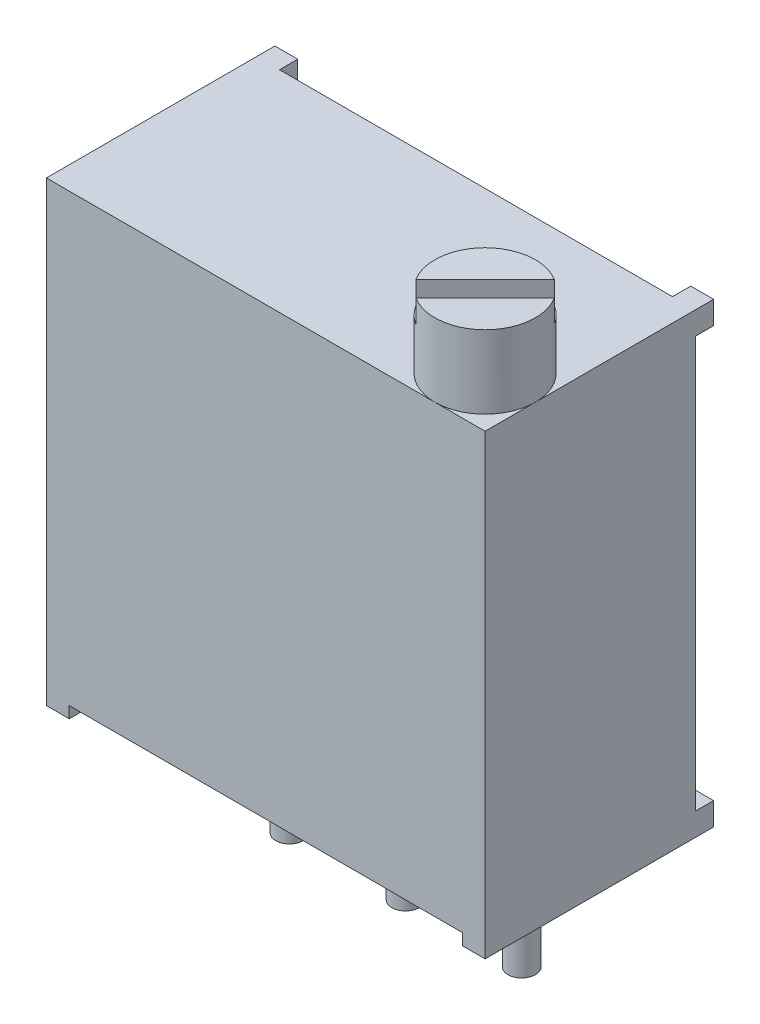
ISO-10303-21;
HEADER;
FILE_DESCRIPTION(('STEP AP214'),'2;1');
FILE_NAME('part.step','',(''),(''),'','','');
FILE_SCHEMA(('AUTOMOTIVE_DESIGN { 1 0 10303 214 1 1 1 1 }'));
ENDSEC;
DATA;
#1=APPLICATION_CONTEXT('core data for automotive mechanical design processes');
#2=APPLICATION_PROTOCOL_DEFINITION('international standard','automotive_design',2000,#1);
#3=PRODUCT_CONTEXT('',#1,'mechanical');
#4=PRODUCT('Part','Part','',(#3));
#5=PRODUCT_RELATED_PRODUCT_CATEGORY('part','',(#4));
#6=PRODUCT_DEFINITION_FORMATION('','',#4);
#7=PRODUCT_DEFINITION_CONTEXT('part definition',#1,'design');
#8=PRODUCT_DEFINITION('design','',#6,#7);
#9=PRODUCT_DEFINITION_SHAPE('','',#8);
#10=(LENGTH_UNIT() NAMED_UNIT(*) SI_UNIT(.MILLI.,.METRE.));
#11=(NAMED_UNIT(*) PLANE_ANGLE_UNIT() SI_UNIT($,.RADIAN.));
#12=(NAMED_UNIT(*) SI_UNIT($,.STERADIAN.) SOLID_ANGLE_UNIT());
#13=UNCERTAINTY_MEASURE_WITH_UNIT(LENGTH_MEASURE(1.E-05),#10,'distance_accuracy_value','');
#14=(GEOMETRIC_REPRESENTATION_CONTEXT(3) GLOBAL_UNCERTAINTY_ASSIGNED_CONTEXT((#13)) GLOBAL_UNIT_ASSIGNED_CONTEXT((#10,
#11,#12)) REPRESENTATION_CONTEXT('',''));
#15=CARTESIAN_POINT('',(0.,0.,0.));
#16=DIRECTION('',(0.,0.,1.));
#17=DIRECTION('',(1.,0.,0.));
#18=AXIS2_PLACEMENT_3D('',#15,#16,#17);
#19=CARTESIAN_POINT('',(1.1,11.6,1.9));
#20=DIRECTION('',(0.,1.,0.));
#21=DIRECTION('',(0.,0.,1.));
#22=AXIS2_PLACEMENT_3D('',#19,#20,#21);
#23=PLANE('',#22);
#24=DIRECTION('',(-0.707106781186547,0.,0.707106781186548));
#25=VECTOR('',#24,1.);
#26=CARTESIAN_POINT('',(0.165760434326207,11.6,2.48068617508052));
#27=LINE('',#26,#25);
#28=CARTESIAN_POINT('',(1.68068617508052,11.6,0.965760434326207));
#29=VERTEX_POINT('',#28);
#30=CARTESIAN_POINT('',(0.165760434326207,11.6,2.48068617508052));
#31=VERTEX_POINT('',#30);
#32=EDGE_CURVE('E87',#29,#31,#27,.T.);
#33=ORIENTED_EDGE('',*,*,#32,.F.);
#34=CARTESIAN_POINT('',(1.1,11.6,1.9));
#35=DIRECTION('',(0.,1.,0.));
#36=DIRECTION('',(0.,0.,1.));
#37=AXIS2_PLACEMENT_3D('',#34,#35,#36);
#38=CIRCLE('',#37,1.1);
#39=EDGE_CURVE('E13',#29,#31,#38,.T.);
#40=ORIENTED_EDGE('',*,*,#39,.T.);
#41=EDGE_LOOP('',(#33,#40));
#42=FACE_BOUND('',#41,.T.);
#43=ADVANCED_FACE('F48',(#42),#23,.T.);
#44=CARTESIAN_POINT('',(1.1,11.6,1.9));
#45=DIRECTION('',(0.,-1.,0.));
#46=DIRECTION('',(0.,0.,-1.));
#47=AXIS2_PLACEMENT_3D('',#44,#45,#46);
#48=CYLINDRICAL_SURFACE('',#47,1.1);
#49=ORIENTED_EDGE('',*,*,#39,.F.);
#50=DIRECTION('',(0.,1.,0.));
#51=VECTOR('',#50,1.);
#52=CARTESIAN_POINT('',(1.68068617508052,11.1,0.965760434326207));
#53=LINE('',#52,#51);
#54=CARTESIAN_POINT('',(1.68068617508052,11.1,0.965760434326207));
#55=VERTEX_POINT('',#54);
#56=EDGE_CURVE('E101',#55,#29,#53,.T.);
#57=ORIENTED_EDGE('',*,*,#56,.F.);
#58=CARTESIAN_POINT('',(1.1,11.1,1.9));
#59=DIRECTION('',(0.,1.,0.));
#60=DIRECTION('',(0.,0.,1.));
#61=AXIS2_PLACEMENT_3D('',#58,#59,#60);
#62=CIRCLE('',#61,1.1);
#63=CARTESIAN_POINT('',(2.03423956567379,11.1,1.31931382491948));
#64=VERTEX_POINT('',#63);
#65=EDGE_CURVE('E105',#64,#55,#62,.T.);
#66=ORIENTED_EDGE('',*,*,#65,.F.);
#67=DIRECTION('',(0.,1.,0.));
#68=VECTOR('',#67,1.);
#69=CARTESIAN_POINT('',(2.03423956567379,11.1,1.31931382491948));
#70=LINE('',#69,#68);
#71=CARTESIAN_POINT('',(2.03423956567379,11.6,1.31931382491948));
#72=VERTEX_POINT('',#71);
#73=EDGE_CURVE('E94',#64,#72,#70,.T.);
#74=ORIENTED_EDGE('',*,*,#73,.T.);
#75=CARTESIAN_POINT('',(0.519313824919481,11.6,2.83423956567379));
#76=VERTEX_POINT('',#75);
#77=EDGE_CURVE('E57',#76,#72,#38,.T.);
#78=ORIENTED_EDGE('',*,*,#77,.F.);
#79=DIRECTION('',(0.,1.,0.));
#80=VECTOR('',#79,1.);
#81=CARTESIAN_POINT('',(0.519313824919481,11.1,2.83423956567379));
#82=LINE('',#81,#80);
#83=CARTESIAN_POINT('',(0.519313824919481,11.1,2.83423956567379));
#84=VERTEX_POINT('',#83);
#85=EDGE_CURVE('E64',#84,#76,#82,.T.);
#86=ORIENTED_EDGE('',*,*,#85,.F.);
#87=CARTESIAN_POINT('',(1.1,11.1,1.9));
#88=DIRECTION('',(0.,1.,0.));
#89=DIRECTION('',(0.,0.,1.));
#90=AXIS2_PLACEMENT_3D('',#87,#88,#89);
#91=CIRCLE('',#90,1.1);
#92=CARTESIAN_POINT('',(0.165760434326207,11.1,2.48068617508052));
#93=VERTEX_POINT('',#92);
#94=EDGE_CURVE('E107',#93,#84,#91,.T.);
#95=ORIENTED_EDGE('',*,*,#94,.F.);
#96=DIRECTION('',(0.,1.,0.));
#97=VECTOR('',#96,1.);
#98=CARTESIAN_POINT('',(0.165760434326207,11.1,2.48068617508052));
#99=LINE('',#98,#97);
#100=EDGE_CURVE('E73',#93,#31,#99,.T.);
#101=ORIENTED_EDGE('',*,*,#100,.T.);
#102=EDGE_LOOP('',(#49,#57,#66,#74,#78,#86,#95,#101));
#103=FACE_BOUND('',#102,.T.);
#104=CARTESIAN_POINT('',(1.1,10.,1.9));
#105=DIRECTION('',(0.,1.,0.));
#106=DIRECTION('',(0.,0.,1.));
#107=AXIS2_PLACEMENT_3D('',#104,#105,#106);
#108=CIRCLE('',#107,1.1);
#109=CARTESIAN_POINT('',(1.1,10.,3.));
#110=VERTEX_POINT('',#109);
#111=EDGE_CURVE('E52',#110,#110,#108,.T.);
#112=ORIENTED_EDGE('',*,*,#111,.T.);
#113=EDGE_LOOP('',(#112));
#114=FACE_BOUND('',#113,.T.);
#115=ADVANCED_FACE('F50',(#103,#114),#48,.T.);
#116=DIRECTION('',(0.707106781186547,0.,-0.707106781186548));
#117=VECTOR('',#116,1.);
#118=CARTESIAN_POINT('',(2.03423956567379,11.6,1.31931382491948));
#119=LINE('',#118,#117);
#120=EDGE_CURVE('E96',#76,#72,#119,.T.);
#121=ORIENTED_EDGE('',*,*,#120,.F.);
#122=ORIENTED_EDGE('',*,*,#77,.T.);
#123=EDGE_LOOP('',(#121,#122));
#124=FACE_BOUND('',#123,.T.);
#125=ADVANCED_FACE('F128',(#124),#23,.T.);
#126=CARTESIAN_POINT('',(1.1,10.,1.9));
#127=DIRECTION('',(0.,1.,0.));
#128=DIRECTION('',(0.,0.,1.));
#129=AXIS2_PLACEMENT_3D('',#126,#127,#128);
#130=PLANE('',#129);
#131=ORIENTED_EDGE('',*,*,#111,.F.);
#132=EDGE_LOOP('',(#131));
#133=FACE_BOUND('',#132,.T.);
#134=ADVANCED_FACE('F125',(#133),#130,.F.);
#135=CARTESIAN_POINT('',(0.165760434326207,11.1,2.48068617508052));
#136=DIRECTION('',(-0.707106781186548,0.,-0.707106781186547));
#137=DIRECTION('',(-0.707106781186547,0.,0.707106781186548));
#138=AXIS2_PLACEMENT_3D('',#135,#136,#137);
#139=PLANE('',#138);
#140=ORIENTED_EDGE('',*,*,#32,.T.);
#141=ORIENTED_EDGE('',*,*,#100,.F.);
#142=DIRECTION('',(-0.707106781186547,0.,0.707106781186548));
#143=VECTOR('',#142,1.);
#144=CARTESIAN_POINT('',(0.165760434326207,11.1,2.48068617508052));
#145=LINE('',#144,#143);
#146=EDGE_CURVE('E112',#55,#93,#145,.T.);
#147=ORIENTED_EDGE('',*,*,#146,.F.);
#148=ORIENTED_EDGE('',*,*,#56,.T.);
#149=EDGE_LOOP('',(#140,#141,#147,#148));
#150=FACE_BOUND('',#149,.T.);
#151=ADVANCED_FACE('F127',(#150),#139,.F.);
#152=CARTESIAN_POINT('',(2.03423956567379,11.1,1.31931382491948));
#153=DIRECTION('',(0.707106781186548,0.,0.707106781186547));
#154=DIRECTION('',(0.707106781186547,0.,-0.707106781186548));
#155=AXIS2_PLACEMENT_3D('',#152,#153,#154);
#156=PLANE('',#155);
#157=ORIENTED_EDGE('',*,*,#120,.T.);
#158=ORIENTED_EDGE('',*,*,#73,.F.);
#159=DIRECTION('',(0.707106781186547,0.,-0.707106781186548));
#160=VECTOR('',#159,1.);
#161=CARTESIAN_POINT('',(2.03423956567379,11.1,1.31931382491948));
#162=LINE('',#161,#160);
#163=EDGE_CURVE('E91',#84,#64,#162,.T.);
#164=ORIENTED_EDGE('',*,*,#163,.F.);
#165=ORIENTED_EDGE('',*,*,#85,.T.);
#166=EDGE_LOOP('',(#157,#158,#164,#165));
#167=FACE_BOUND('',#166,.T.);
#168=ADVANCED_FACE('F95',(#167),#156,.F.);
#169=CARTESIAN_POINT('',(1.1,11.1,1.9));
#170=DIRECTION('',(0.,1.,0.));
#171=DIRECTION('',(0.,0.,1.));
#172=AXIS2_PLACEMENT_3D('',#169,#170,#171);
#173=PLANE('',#172);
#174=ORIENTED_EDGE('',*,*,#94,.T.);
#175=ORIENTED_EDGE('',*,*,#163,.T.);
#176=ORIENTED_EDGE('',*,*,#65,.T.);
#177=ORIENTED_EDGE('',*,*,#146,.T.);
#178=EDGE_LOOP('',(#174,#175,#176,#177));
#179=FACE_BOUND('',#178,.T.);
#180=ADVANCED_FACE('F104',(#179),#173,.T.);
#181=CLOSED_SHELL('',(#43,#115,#125,#134,#151,#168,#180));
#182=MANIFOLD_SOLID_BREP('B2',#181);
#183=CARTESIAN_POINT('',(-6.9,0.25,3.));
#184=DIRECTION('',(0.,1.,0.));
#185=DIRECTION('',(0.,0.,1.));
#186=AXIS2_PLACEMENT_3D('',#183,#184,#185);
#187=PLANE('',#186);
#188=CARTESIAN_POINT('',(-2.54,0.25,0.));
#189=DIRECTION('',(0.,1.,0.));
#190=DIRECTION('',(0.,0.,1.));
#191=AXIS2_PLACEMENT_3D('',#188,#189,#190);
#192=CIRCLE('',#191,0.3);
#193=CARTESIAN_POINT('',(-2.54,0.25,0.3));
#194=VERTEX_POINT('',#193);
#195=EDGE_CURVE('E194',#194,#194,#192,.F.);
#196=ORIENTED_EDGE('',*,*,#195,.F.);
#197=EDGE_LOOP('',(#196));
#198=FACE_BOUND('',#197,.T.);
#199=DIRECTION('',(0.,0.,-1.));
#200=VECTOR('',#199,1.);
#201=CARTESIAN_POINT('',(-6.9,0.25,-1.6));
#202=LINE('',#201,#200);
#203=CARTESIAN_POINT('',(-6.9,0.25,3.));
#204=VERTEX_POINT('',#203);
#205=CARTESIAN_POINT('',(-6.9,0.25,-1.6));
#206=VERTEX_POINT('',#205);
#207=EDGE_CURVE('E320',#204,#206,#202,.T.);
#208=ORIENTED_EDGE('',*,*,#207,.T.);
#209=DIRECTION('',(1.,0.,0.));
#210=VECTOR('',#209,1.);
#211=CARTESIAN_POINT('',(-6.9,0.25,-1.6));
#212=LINE('',#211,#210);
#213=CARTESIAN_POINT('',(1.7,0.25,-1.6));
#214=VERTEX_POINT('',#213);
#215=EDGE_CURVE('E324',#206,#214,#212,.T.);
#216=ORIENTED_EDGE('',*,*,#215,.T.);
#217=DIRECTION('',(0.,0.,1.));
#218=VECTOR('',#217,1.);
#219=CARTESIAN_POINT('',(1.7,0.25,-1.6));
#220=LINE('',#219,#218);
#221=CARTESIAN_POINT('',(1.7,0.25,3.));
#222=VERTEX_POINT('',#221);
#223=EDGE_CURVE('E341',#214,#222,#220,.T.);
#224=ORIENTED_EDGE('',*,*,#223,.T.);
#225=DIRECTION('',(-1.,0.,0.));
#226=VECTOR('',#225,1.);
#227=CARTESIAN_POINT('',(-6.9,0.25,3.));
#228=LINE('',#227,#226);
#229=EDGE_CURVE('E327',#222,#204,#228,.T.);
#230=ORIENTED_EDGE('',*,*,#229,.T.);
#231=EDGE_LOOP('',(#208,#216,#224,#230));
#232=FACE_BOUND('',#231,.T.);
#233=CARTESIAN_POINT('',(0.,0.25,0.));
#234=DIRECTION('',(0.,1.,0.));
#235=DIRECTION('',(0.,0.,1.));
#236=AXIS2_PLACEMENT_3D('',#233,#234,#235);
#237=CIRCLE('',#236,0.3);
#238=CARTESIAN_POINT('',(0.,0.25,0.3));
#239=VERTEX_POINT('',#238);
#240=EDGE_CURVE('E455',#239,#239,#237,.F.);
#241=ORIENTED_EDGE('',*,*,#240,.F.);
#242=EDGE_LOOP('',(#241));
#243=FACE_BOUND('',#242,.T.);
#244=CARTESIAN_POINT('',(-5.08,0.25,0.));
#245=DIRECTION('',(0.,1.,0.));
#246=DIRECTION('',(0.,0.,1.));
#247=AXIS2_PLACEMENT_3D('',#244,#245,#246);
#248=CIRCLE('',#247,0.3);
#249=CARTESIAN_POINT('',(-5.08,0.25,0.299999999999999));
#250=VERTEX_POINT('',#249);
#251=EDGE_CURVE('E46',#250,#250,#248,.F.);
#252=ORIENTED_EDGE('',*,*,#251,.F.);
#253=EDGE_LOOP('',(#252));
#254=FACE_BOUND('',#253,.T.);
#255=ADVANCED_FACE('F185',(#198,#232,#243,#254),#187,.F.);
#256=CARTESIAN_POINT('',(2.2,0.,3.));
#257=DIRECTION('',(0.,-1.,0.));
#258=DIRECTION('',(0.,0.,-1.));
#259=AXIS2_PLACEMENT_3D('',#256,#257,#258);
#260=PLANE('',#259);
#261=DIRECTION('',(0.,0.,-1.));
#262=VECTOR('',#261,1.);
#263=CARTESIAN_POINT('',(-6.9,0.,-1.6));
#264=LINE('',#263,#262);
#265=CARTESIAN_POINT('',(-6.9,0.,3.));
#266=VERTEX_POINT('',#265);
#267=CARTESIAN_POINT('',(-6.9,0.,-2.));
#268=VERTEX_POINT('',#267);
#269=EDGE_CURVE('E362',#266,#268,#264,.T.);
#270=ORIENTED_EDGE('',*,*,#269,.F.);
#271=DIRECTION('',(1.,0.,0.));
#272=VECTOR('',#271,1.);
#273=CARTESIAN_POINT('',(2.2,0.,3.));
#274=LINE('',#273,#272);
#275=CARTESIAN_POINT('',(-7.4,0.,3.));
#276=VERTEX_POINT('',#275);
#277=EDGE_CURVE('E429',#276,#266,#274,.T.);
#278=ORIENTED_EDGE('',*,*,#277,.F.);
#279=DIRECTION('',(0.,0.,1.));
#280=VECTOR('',#279,1.);
#281=CARTESIAN_POINT('',(-7.4,0.,-2.));
#282=LINE('',#281,#280);
#283=CARTESIAN_POINT('',(-7.4,0.,-2.));
#284=VERTEX_POINT('',#283);
#285=EDGE_CURVE('E219',#284,#276,#282,.T.);
#286=ORIENTED_EDGE('',*,*,#285,.F.);
#287=DIRECTION('',(-1.,0.,0.));
#288=VECTOR('',#287,1.);
#289=CARTESIAN_POINT('',(2.2,0.,-2.));
#290=LINE('',#289,#288);
#291=EDGE_CURVE('E437',#268,#284,#290,.T.);
#292=ORIENTED_EDGE('',*,*,#291,.F.);
#293=EDGE_LOOP('',(#270,#278,#286,#292));
#294=FACE_BOUND('',#293,.T.);
#295=ADVANCED_FACE('F463',(#294),#260,.T.);
#296=CARTESIAN_POINT('',(2.2,10.,-2.));
#297=DIRECTION('',(0.,0.,1.));
#298=DIRECTION('',(1.,0.,0.));
#299=AXIS2_PLACEMENT_3D('',#296,#297,#298);
#300=PLANE('',#299);
#301=DIRECTION('',(-1.,0.,0.));
#302=VECTOR('',#301,1.);
#303=CARTESIAN_POINT('',(-7.4,9.5,-2.));
#304=LINE('',#303,#302);
#305=CARTESIAN_POINT('',(-6.9,9.5,-2.));
#306=VERTEX_POINT('',#305);
#307=CARTESIAN_POINT('',(-7.4,9.5,-2.));
#308=VERTEX_POINT('',#307);
#309=EDGE_CURVE('E406',#306,#308,#304,.T.);
#310=ORIENTED_EDGE('',*,*,#309,.T.);
#311=DIRECTION('',(0.,-1.,0.));
#312=VECTOR('',#311,1.);
#313=CARTESIAN_POINT('',(-7.4,10.,-2.));
#314=LINE('',#313,#312);
#315=CARTESIAN_POINT('',(-7.4,10.,-2.));
#316=VERTEX_POINT('',#315);
#317=EDGE_CURVE('E448',#316,#308,#314,.T.);
#318=ORIENTED_EDGE('',*,*,#317,.F.);
#319=DIRECTION('',(-1.,0.,0.));
#320=VECTOR('',#319,1.);
#321=CARTESIAN_POINT('',(2.2,10.,-2.));
#322=LINE('',#321,#320);
#323=CARTESIAN_POINT('',(-6.9,10.,-2.));
#324=VERTEX_POINT('',#323);
#325=EDGE_CURVE('E428',#324,#316,#322,.T.);
#326=ORIENTED_EDGE('',*,*,#325,.F.);
#327=DIRECTION('',(0.,-1.,0.));
#328=VECTOR('',#327,1.);
#329=CARTESIAN_POINT('',(-6.9,10.,-2.));
#330=LINE('',#329,#328);
#331=EDGE_CURVE('E397',#324,#306,#330,.T.);
#332=ORIENTED_EDGE('',*,*,#331,.T.);
#333=EDGE_LOOP('',(#310,#318,#326,#332));
#334=FACE_BOUND('',#333,.T.);
#335=ADVANCED_FACE('F468',(#334),#300,.F.);
#336=DIRECTION('',(0.,1.,0.));
#337=VECTOR('',#336,1.);
#338=CARTESIAN_POINT('',(1.7,10.,-2.));
#339=LINE('',#338,#337);
#340=CARTESIAN_POINT('',(1.7,9.5,-2.));
#341=VERTEX_POINT('',#340);
#342=CARTESIAN_POINT('',(1.7,10.,-2.));
#343=VERTEX_POINT('',#342);
#344=EDGE_CURVE('E387',#341,#343,#339,.T.);
#345=ORIENTED_EDGE('',*,*,#344,.T.);
#346=CARTESIAN_POINT('',(2.2,10.,-2.));
#347=VERTEX_POINT('',#346);
#348=EDGE_CURVE('E430',#347,#343,#322,.T.);
#349=ORIENTED_EDGE('',*,*,#348,.F.);
#350=DIRECTION('',(0.,-1.,0.));
#351=VECTOR('',#350,1.);
#352=CARTESIAN_POINT('',(2.2,10.,-2.));
#353=LINE('',#352,#351);
#354=CARTESIAN_POINT('',(2.2,9.5,-2.));
#355=VERTEX_POINT('',#354);
#356=EDGE_CURVE('E452',#347,#355,#353,.T.);
#357=ORIENTED_EDGE('',*,*,#356,.T.);
#358=DIRECTION('',(-1.,0.,0.));
#359=VECTOR('',#358,1.);
#360=CARTESIAN_POINT('',(2.2,9.5,-2.));
#361=LINE('',#360,#359);
#362=EDGE_CURVE('E378',#355,#341,#361,.T.);
#363=ORIENTED_EDGE('',*,*,#362,.T.);
#364=EDGE_LOOP('',(#345,#349,#357,#363));
#365=FACE_BOUND('',#364,.T.);
#366=ADVANCED_FACE('F520',(#365),#300,.F.);
#367=DIRECTION('',(1.,0.,0.));
#368=VECTOR('',#367,1.);
#369=CARTESIAN_POINT('',(2.2,0.499999999999999,-2.));
#370=LINE('',#369,#368);
#371=CARTESIAN_POINT('',(1.7,0.499999999999999,-2.));
#372=VERTEX_POINT('',#371);
#373=CARTESIAN_POINT('',(2.2,0.499999999999999,-2.));
#374=VERTEX_POINT('',#373);
#375=EDGE_CURVE('E368',#372,#374,#370,.T.);
#376=ORIENTED_EDGE('',*,*,#375,.T.);
#377=CARTESIAN_POINT('',(2.2,0.,-2.));
#378=VERTEX_POINT('',#377);
#379=EDGE_CURVE('E451',#374,#378,#353,.T.);
#380=ORIENTED_EDGE('',*,*,#379,.T.);
#381=CARTESIAN_POINT('',(1.7,0.,-2.));
#382=VERTEX_POINT('',#381);
#383=EDGE_CURVE('E438',#378,#382,#290,.T.);
#384=ORIENTED_EDGE('',*,*,#383,.T.);
#385=DIRECTION('',(0.,1.,0.));
#386=VECTOR('',#385,1.);
#387=CARTESIAN_POINT('',(1.7,0.,-2.));
#388=LINE('',#387,#386);
#389=EDGE_CURVE('E364',#382,#372,#388,.T.);
#390=ORIENTED_EDGE('',*,*,#389,.T.);
#391=EDGE_LOOP('',(#376,#380,#384,#390));
#392=FACE_BOUND('',#391,.T.);
#393=ADVANCED_FACE('F525',(#392),#300,.F.);
#394=DIRECTION('',(0.,-1.,0.));
#395=VECTOR('',#394,1.);
#396=CARTESIAN_POINT('',(-6.9,0.,-2.));
#397=LINE('',#396,#395);
#398=CARTESIAN_POINT('',(-6.9,0.499999999999999,-2.));
#399=VERTEX_POINT('',#398);
#400=EDGE_CURVE('E352',#399,#268,#397,.T.);
#401=ORIENTED_EDGE('',*,*,#400,.T.);
#402=ORIENTED_EDGE('',*,*,#291,.T.);
#403=CARTESIAN_POINT('',(-7.4,0.499999999999999,-2.));
#404=VERTEX_POINT('',#403);
#405=EDGE_CURVE('E447',#404,#284,#314,.T.);
#406=ORIENTED_EDGE('',*,*,#405,.F.);
#407=DIRECTION('',(1.,0.,0.));
#408=VECTOR('',#407,1.);
#409=CARTESIAN_POINT('',(-7.4,0.499999999999999,-2.));
#410=LINE('',#409,#408);
#411=EDGE_CURVE('E356',#404,#399,#410,.T.);
#412=ORIENTED_EDGE('',*,*,#411,.T.);
#413=EDGE_LOOP('',(#401,#402,#406,#412));
#414=FACE_BOUND('',#413,.T.);
#415=ADVANCED_FACE('F518',(#414),#300,.F.);
#416=CARTESIAN_POINT('',(-7.4,10.,-2.));
#417=DIRECTION('',(1.,0.,0.));
#418=DIRECTION('',(0.,0.,-1.));
#419=AXIS2_PLACEMENT_3D('',#416,#417,#418);
#420=PLANE('',#419);
#421=DIRECTION('',(0.,0.,-1.));
#422=VECTOR('',#421,1.);
#423=CARTESIAN_POINT('',(-7.4,9.5,-1.6));
#424=LINE('',#423,#422);
#425=CARTESIAN_POINT('',(-7.4,9.5,-1.6));
#426=VERTEX_POINT('',#425);
#427=EDGE_CURVE('E414',#426,#308,#424,.T.);
#428=ORIENTED_EDGE('',*,*,#427,.F.);
#429=DIRECTION('',(0.,1.,0.));
#430=VECTOR('',#429,1.);
#431=CARTESIAN_POINT('',(-7.4,10.,-1.6));
#432=LINE('',#431,#430);
#433=CARTESIAN_POINT('',(-7.4,0.499999999999999,-1.6));
#434=VERTEX_POINT('',#433);
#435=EDGE_CURVE('E422',#434,#426,#432,.T.);
#436=ORIENTED_EDGE('',*,*,#435,.F.);
#437=DIRECTION('',(0.,0.,-1.));
#438=VECTOR('',#437,1.);
#439=CARTESIAN_POINT('',(-7.4,0.499999999999999,-1.6));
#440=LINE('',#439,#438);
#441=EDGE_CURVE('E347',#434,#404,#440,.T.);
#442=ORIENTED_EDGE('',*,*,#441,.T.);
#443=ORIENTED_EDGE('',*,*,#405,.T.);
#444=ORIENTED_EDGE('',*,*,#285,.T.);
#445=DIRECTION('',(0.,-1.,0.));
#446=VECTOR('',#445,1.);
#447=CARTESIAN_POINT('',(-7.4,10.,3.));
#448=LINE('',#447,#446);
#449=CARTESIAN_POINT('',(-7.4,10.,3.));
#450=VERTEX_POINT('',#449);
#451=EDGE_CURVE('E445',#450,#276,#448,.T.);
#452=ORIENTED_EDGE('',*,*,#451,.F.);
#453=DIRECTION('',(0.,0.,1.));
#454=VECTOR('',#453,1.);
#455=CARTESIAN_POINT('',(-7.4,10.,-2.));
#456=LINE('',#455,#454);
#457=EDGE_CURVE('E432',#316,#450,#456,.T.);
#458=ORIENTED_EDGE('',*,*,#457,.F.);
#459=ORIENTED_EDGE('',*,*,#317,.T.);
#460=EDGE_LOOP('',(#428,#436,#442,#443,#444,#452,#458,#459));
#461=FACE_BOUND('',#460,.T.);
#462=ADVANCED_FACE('F513',(#461),#420,.F.);
#463=CARTESIAN_POINT('',(1.7,0.,3.));
#464=VERTEX_POINT('',#463);
#465=CARTESIAN_POINT('',(2.2,0.,3.));
#466=VERTEX_POINT('',#465);
#467=EDGE_CURVE('E226',#464,#466,#274,.T.);
#468=ORIENTED_EDGE('',*,*,#467,.F.);
#469=DIRECTION('',(0.,0.,-1.));
#470=VECTOR('',#469,1.);
#471=CARTESIAN_POINT('',(1.7,0.,-1.6));
#472=LINE('',#471,#470);
#473=EDGE_CURVE('E371',#464,#382,#472,.T.);
#474=ORIENTED_EDGE('',*,*,#473,.T.);
#475=ORIENTED_EDGE('',*,*,#383,.F.);
#476=DIRECTION('',(0.,0.,-1.));
#477=VECTOR('',#476,1.);
#478=CARTESIAN_POINT('',(2.2,0.,-2.));
#479=LINE('',#478,#477);
#480=EDGE_CURVE('E426',#466,#378,#479,.T.);
#481=ORIENTED_EDGE('',*,*,#480,.F.);
#482=EDGE_LOOP('',(#468,#474,#475,#481));
#483=FACE_BOUND('',#482,.T.);
#484=ADVANCED_FACE('F471',(#483),#260,.T.);
#485=CARTESIAN_POINT('',(2.2,10.,-2.));
#486=DIRECTION('',(-1.,0.,0.));
#487=DIRECTION('',(0.,0.,1.));
#488=AXIS2_PLACEMENT_3D('',#485,#486,#487);
#489=PLANE('',#488);
#490=DIRECTION('',(0.,0.,-1.));
#491=VECTOR('',#490,1.);
#492=CARTESIAN_POINT('',(2.2,0.499999999999999,-1.6));
#493=LINE('',#492,#491);
#494=CARTESIAN_POINT('',(2.2,0.499999999999999,-1.6));
#495=VERTEX_POINT('',#494);
#496=EDGE_CURVE('E376',#495,#374,#493,.T.);
#497=ORIENTED_EDGE('',*,*,#496,.F.);
#498=DIRECTION('',(0.,-1.,0.));
#499=VECTOR('',#498,1.);
#500=CARTESIAN_POINT('',(2.2,10.,-1.6));
#501=LINE('',#500,#499);
#502=CARTESIAN_POINT('',(2.2,9.5,-1.6));
#503=VERTEX_POINT('',#502);
#504=EDGE_CURVE('E424',#503,#495,#501,.T.);
#505=ORIENTED_EDGE('',*,*,#504,.F.);
#506=DIRECTION('',(0.,0.,-1.));
#507=VECTOR('',#506,1.);
#508=CARTESIAN_POINT('',(2.2,9.5,-1.6));
#509=LINE('',#508,#507);
#510=EDGE_CURVE('E390',#503,#355,#509,.T.);
#511=ORIENTED_EDGE('',*,*,#510,.T.);
#512=ORIENTED_EDGE('',*,*,#356,.F.);
#513=DIRECTION('',(0.,0.,-1.));
#514=VECTOR('',#513,1.);
#515=CARTESIAN_POINT('',(2.2,10.,-2.));
#516=LINE('',#515,#514);
#517=CARTESIAN_POINT('',(2.2,10.,3.));
#518=VERTEX_POINT('',#517);
#519=EDGE_CURVE('E231',#518,#347,#516,.T.);
#520=ORIENTED_EDGE('',*,*,#519,.F.);
#521=DIRECTION('',(0.,-1.,0.));
#522=VECTOR('',#521,1.);
#523=CARTESIAN_POINT('',(2.2,10.,3.));
#524=LINE('',#523,#522);
#525=EDGE_CURVE('E435',#518,#466,#524,.T.);
#526=ORIENTED_EDGE('',*,*,#525,.T.);
#527=ORIENTED_EDGE('',*,*,#480,.T.);
#528=ORIENTED_EDGE('',*,*,#379,.F.);
#529=EDGE_LOOP('',(#497,#505,#511,#512,#520,#526,#527,#528));
#530=FACE_BOUND('',#529,.T.);
#531=ADVANCED_FACE('F187',(#530),#489,.F.);
#532=CARTESIAN_POINT('',(2.2,10.,3.));
#533=DIRECTION('',(0.,0.,-1.));
#534=DIRECTION('',(-1.,0.,0.));
#535=AXIS2_PLACEMENT_3D('',#532,#533,#534);
#536=PLANE('',#535);
#537=ORIENTED_EDGE('',*,*,#277,.T.);
#538=DIRECTION('',(0.,-1.,0.));
#539=VECTOR('',#538,1.);
#540=CARTESIAN_POINT('',(-6.9,0.25,3.));
#541=LINE('',#540,#539);
#542=EDGE_CURVE('E359',#204,#266,#541,.T.);
#543=ORIENTED_EDGE('',*,*,#542,.F.);
#544=ORIENTED_EDGE('',*,*,#229,.F.);
#545=DIRECTION('',(0.,-1.,0.));
#546=VECTOR('',#545,1.);
#547=CARTESIAN_POINT('',(1.7,0.25,3.));
#548=LINE('',#547,#546);
#549=EDGE_CURVE('E560',#222,#464,#548,.T.);
#550=ORIENTED_EDGE('',*,*,#549,.T.);
#551=ORIENTED_EDGE('',*,*,#467,.T.);
#552=ORIENTED_EDGE('',*,*,#525,.F.);
#553=DIRECTION('',(1.,0.,0.));
#554=VECTOR('',#553,1.);
#555=CARTESIAN_POINT('',(2.2,10.,3.));
#556=LINE('',#555,#554);
#557=EDGE_CURVE('E202',#450,#518,#556,.T.);
#558=ORIENTED_EDGE('',*,*,#557,.F.);
#559=ORIENTED_EDGE('',*,*,#451,.T.);
#560=EDGE_LOOP('',(#537,#543,#544,#550,#551,#552,#558,#559));
#561=FACE_BOUND('',#560,.T.);
#562=ADVANCED_FACE('F510',(#561),#536,.F.);
#563=CARTESIAN_POINT('',(2.2,10.,3.));
#564=DIRECTION('',(0.,-1.,0.));
#565=DIRECTION('',(0.,0.,-1.));
#566=AXIS2_PLACEMENT_3D('',#563,#564,#565);
#567=PLANE('',#566);
#568=DIRECTION('',(0.,0.,-1.));
#569=VECTOR('',#568,1.);
#570=CARTESIAN_POINT('',(1.7,10.,-1.6));
#571=LINE('',#570,#569);
#572=CARTESIAN_POINT('',(1.7,10.,-1.6));
#573=VERTEX_POINT('',#572);
#574=EDGE_CURVE('E395',#573,#343,#571,.T.);
#575=ORIENTED_EDGE('',*,*,#574,.F.);
#576=DIRECTION('',(1.,0.,0.));
#577=VECTOR('',#576,1.);
#578=CARTESIAN_POINT('',(2.2,10.,-1.6));
#579=LINE('',#578,#577);
#580=CARTESIAN_POINT('',(-6.9,10.,-1.6));
#581=VERTEX_POINT('',#580);
#582=EDGE_CURVE('E416',#581,#573,#579,.T.);
#583=ORIENTED_EDGE('',*,*,#582,.F.);
#584=DIRECTION('',(0.,0.,-1.));
#585=VECTOR('',#584,1.);
#586=CARTESIAN_POINT('',(-6.9,10.,-1.6));
#587=LINE('',#586,#585);
#588=EDGE_CURVE('E409',#581,#324,#587,.T.);
#589=ORIENTED_EDGE('',*,*,#588,.T.);
#590=ORIENTED_EDGE('',*,*,#325,.T.);
#591=ORIENTED_EDGE('',*,*,#457,.T.);
#592=ORIENTED_EDGE('',*,*,#557,.T.);
#593=ORIENTED_EDGE('',*,*,#519,.T.);
#594=ORIENTED_EDGE('',*,*,#348,.T.);
#595=EDGE_LOOP('',(#575,#583,#589,#590,#591,#592,#593,#594));
#596=FACE_BOUND('',#595,.T.);
#597=ADVANCED_FACE('F508',(#596),#567,.F.);
#598=CARTESIAN_POINT('',(-2.6,5.,-1.6));
#599=DIRECTION('',(0.,0.,-1.));
#600=DIRECTION('',(-1.,0.,0.));
#601=AXIS2_PLACEMENT_3D('',#598,#599,#600);
#602=PLANE('',#601);
#603=ORIENTED_EDGE('',*,*,#215,.F.);
#604=DIRECTION('',(0.,-1.,0.));
#605=VECTOR('',#604,1.);
#606=CARTESIAN_POINT('',(-6.9,0.,-1.6));
#607=LINE('',#606,#605);
#608=CARTESIAN_POINT('',(-6.9,0.499999999999999,-1.6));
#609=VERTEX_POINT('',#608);
#610=EDGE_CURVE('E337',#609,#206,#607,.T.);
#611=ORIENTED_EDGE('',*,*,#610,.F.);
#612=DIRECTION('',(1.,0.,0.));
#613=VECTOR('',#612,1.);
#614=CARTESIAN_POINT('',(-7.4,0.499999999999999,-1.6));
#615=LINE('',#614,#613);
#616=EDGE_CURVE('E348',#434,#609,#615,.T.);
#617=ORIENTED_EDGE('',*,*,#616,.F.);
#618=ORIENTED_EDGE('',*,*,#435,.T.);
#619=DIRECTION('',(-1.,0.,0.));
#620=VECTOR('',#619,1.);
#621=CARTESIAN_POINT('',(-7.4,9.5,-1.6));
#622=LINE('',#621,#620);
#623=CARTESIAN_POINT('',(-6.9,9.5,-1.6));
#624=VERTEX_POINT('',#623);
#625=EDGE_CURVE('E405',#624,#426,#622,.T.);
#626=ORIENTED_EDGE('',*,*,#625,.F.);
#627=DIRECTION('',(0.,-1.,0.));
#628=VECTOR('',#627,1.);
#629=CARTESIAN_POINT('',(-6.9,10.,-1.6));
#630=LINE('',#629,#628);
#631=EDGE_CURVE('E402',#581,#624,#630,.T.);
#632=ORIENTED_EDGE('',*,*,#631,.F.);
#633=ORIENTED_EDGE('',*,*,#582,.T.);
#634=DIRECTION('',(0.,1.,0.));
#635=VECTOR('',#634,1.);
#636=CARTESIAN_POINT('',(1.7,10.,-1.6));
#637=LINE('',#636,#635);
#638=CARTESIAN_POINT('',(1.7,9.5,-1.6));
#639=VERTEX_POINT('',#638);
#640=EDGE_CURVE('E386',#639,#573,#637,.T.);
#641=ORIENTED_EDGE('',*,*,#640,.F.);
#642=DIRECTION('',(-1.,0.,0.));
#643=VECTOR('',#642,1.);
#644=CARTESIAN_POINT('',(2.2,9.5,-1.6));
#645=LINE('',#644,#643);
#646=EDGE_CURVE('E383',#503,#639,#645,.T.);
#647=ORIENTED_EDGE('',*,*,#646,.F.);
#648=ORIENTED_EDGE('',*,*,#504,.T.);
#649=DIRECTION('',(1.,0.,0.));
#650=VECTOR('',#649,1.);
#651=CARTESIAN_POINT('',(2.2,0.499999999999999,-1.6));
#652=LINE('',#651,#650);
#653=CARTESIAN_POINT('',(1.7,0.499999999999999,-1.6));
#654=VERTEX_POINT('',#653);
#655=EDGE_CURVE('E367',#654,#495,#652,.T.);
#656=ORIENTED_EDGE('',*,*,#655,.F.);
#657=DIRECTION('',(0.,1.,0.));
#658=VECTOR('',#657,1.);
#659=CARTESIAN_POINT('',(1.7,0.,-1.6));
#660=LINE('',#659,#658);
#661=EDGE_CURVE('E340',#214,#654,#660,.T.);
#662=ORIENTED_EDGE('',*,*,#661,.F.);
#663=EDGE_LOOP('',(#603,#611,#617,#618,#626,#632,#633,#641,#647,#648,#656,#662));
#664=FACE_BOUND('',#663,.T.);
#665=ADVANCED_FACE('F335',(#664),#602,.T.);
#666=CARTESIAN_POINT('',(-7.4,9.5,-1.6));
#667=DIRECTION('',(0.,-1.,0.));
#668=DIRECTION('',(1.,0.,0.));
#669=AXIS2_PLACEMENT_3D('',#666,#667,#668);
#670=PLANE('',#669);
#671=ORIENTED_EDGE('',*,*,#309,.F.);
#672=DIRECTION('',(0.,0.,-1.));
#673=VECTOR('',#672,1.);
#674=CARTESIAN_POINT('',(-6.9,9.5,-1.6));
#675=LINE('',#674,#673);
#676=EDGE_CURVE('E417',#624,#306,#675,.T.);
#677=ORIENTED_EDGE('',*,*,#676,.F.);
#678=ORIENTED_EDGE('',*,*,#625,.T.);
#679=ORIENTED_EDGE('',*,*,#427,.T.);
#680=EDGE_LOOP('',(#671,#677,#678,#679));
#681=FACE_BOUND('',#680,.T.);
#682=ADVANCED_FACE('F499',(#681),#670,.T.);
#683=CARTESIAN_POINT('',(-6.9,10.,-1.6));
#684=DIRECTION('',(1.,0.,0.));
#685=DIRECTION('',(0.,1.,0.));
#686=AXIS2_PLACEMENT_3D('',#683,#684,#685);
#687=PLANE('',#686);
#688=ORIENTED_EDGE('',*,*,#331,.F.);
#689=ORIENTED_EDGE('',*,*,#588,.F.);
#690=ORIENTED_EDGE('',*,*,#631,.T.);
#691=ORIENTED_EDGE('',*,*,#676,.T.);
#692=EDGE_LOOP('',(#688,#689,#690,#691));
#693=FACE_BOUND('',#692,.T.);
#694=ADVANCED_FACE('F494',(#693),#687,.T.);
#695=CARTESIAN_POINT('',(1.7,10.,-1.6));
#696=DIRECTION('',(-1.,0.,0.));
#697=DIRECTION('',(0.,0.,1.));
#698=AXIS2_PLACEMENT_3D('',#695,#696,#697);
#699=PLANE('',#698);
#700=ORIENTED_EDGE('',*,*,#344,.F.);
#701=DIRECTION('',(0.,0.,-1.));
#702=VECTOR('',#701,1.);
#703=CARTESIAN_POINT('',(1.7,9.5,-1.6));
#704=LINE('',#703,#702);
#705=EDGE_CURVE('E398',#639,#341,#704,.T.);
#706=ORIENTED_EDGE('',*,*,#705,.F.);
#707=ORIENTED_EDGE('',*,*,#640,.T.);
#708=ORIENTED_EDGE('',*,*,#574,.T.);
#709=EDGE_LOOP('',(#700,#706,#707,#708));
#710=FACE_BOUND('',#709,.T.);
#711=ADVANCED_FACE('F491',(#710),#699,.T.);
#712=CARTESIAN_POINT('',(2.2,9.5,-1.6));
#713=DIRECTION('',(0.,-1.,0.));
#714=DIRECTION('',(0.,0.,-1.));
#715=AXIS2_PLACEMENT_3D('',#712,#713,#714);
#716=PLANE('',#715);
#717=ORIENTED_EDGE('',*,*,#362,.F.);
#718=ORIENTED_EDGE('',*,*,#510,.F.);
#719=ORIENTED_EDGE('',*,*,#646,.T.);
#720=ORIENTED_EDGE('',*,*,#705,.T.);
#721=EDGE_LOOP('',(#717,#718,#719,#720));
#722=FACE_BOUND('',#721,.T.);
#723=ADVANCED_FACE('F486',(#722),#716,.T.);
#724=CARTESIAN_POINT('',(2.2,0.499999999999999,-1.6));
#725=DIRECTION('',(0.,1.,0.));
#726=DIRECTION('',(0.,0.,1.));
#727=AXIS2_PLACEMENT_3D('',#724,#725,#726);
#728=PLANE('',#727);
#729=ORIENTED_EDGE('',*,*,#375,.F.);
#730=DIRECTION('',(0.,0.,-1.));
#731=VECTOR('',#730,1.);
#732=CARTESIAN_POINT('',(1.7,0.499999999999999,-1.6));
#733=LINE('',#732,#731);
#734=EDGE_CURVE('E379',#654,#372,#733,.T.);
#735=ORIENTED_EDGE('',*,*,#734,.F.);
#736=ORIENTED_EDGE('',*,*,#655,.T.);
#737=ORIENTED_EDGE('',*,*,#496,.T.);
#738=EDGE_LOOP('',(#729,#735,#736,#737));
#739=FACE_BOUND('',#738,.T.);
#740=ADVANCED_FACE('F483',(#739),#728,.T.);
#741=CARTESIAN_POINT('',(1.7,0.,-1.6));
#742=DIRECTION('',(-1.,0.,0.));
#743=DIRECTION('',(0.,0.,1.));
#744=AXIS2_PLACEMENT_3D('',#741,#742,#743);
#745=PLANE('',#744);
#746=ORIENTED_EDGE('',*,*,#389,.F.);
#747=ORIENTED_EDGE('',*,*,#473,.F.);
#748=ORIENTED_EDGE('',*,*,#549,.F.);
#749=ORIENTED_EDGE('',*,*,#223,.F.);
#750=ORIENTED_EDGE('',*,*,#661,.T.);
#751=ORIENTED_EDGE('',*,*,#734,.T.);
#752=EDGE_LOOP('',(#746,#747,#748,#749,#750,#751));
#753=FACE_BOUND('',#752,.T.);
#754=ADVANCED_FACE('F479',(#753),#745,.T.);
#755=CARTESIAN_POINT('',(-6.9,0.,-1.6));
#756=DIRECTION('',(1.,0.,0.));
#757=DIRECTION('',(0.,0.,-1.));
#758=AXIS2_PLACEMENT_3D('',#755,#756,#757);
#759=PLANE('',#758);
#760=ORIENTED_EDGE('',*,*,#400,.F.);
#761=DIRECTION('',(0.,0.,-1.));
#762=VECTOR('',#761,1.);
#763=CARTESIAN_POINT('',(-6.9,0.499999999999999,-1.6));
#764=LINE('',#763,#762);
#765=EDGE_CURVE('E345',#609,#399,#764,.T.);
#766=ORIENTED_EDGE('',*,*,#765,.F.);
#767=ORIENTED_EDGE('',*,*,#610,.T.);
#768=ORIENTED_EDGE('',*,*,#207,.F.);
#769=ORIENTED_EDGE('',*,*,#542,.T.);
#770=ORIENTED_EDGE('',*,*,#269,.T.);
#771=EDGE_LOOP('',(#760,#766,#767,#768,#769,#770));
#772=FACE_BOUND('',#771,.T.);
#773=ADVANCED_FACE('F344',(#772),#759,.T.);
#774=CARTESIAN_POINT('',(-7.4,0.499999999999999,-1.6));
#775=DIRECTION('',(0.,1.,0.));
#776=DIRECTION('',(-1.,0.,0.));
#777=AXIS2_PLACEMENT_3D('',#774,#775,#776);
#778=PLANE('',#777);
#779=ORIENTED_EDGE('',*,*,#411,.F.);
#780=ORIENTED_EDGE('',*,*,#441,.F.);
#781=ORIENTED_EDGE('',*,*,#616,.T.);
#782=ORIENTED_EDGE('',*,*,#765,.T.);
#783=EDGE_LOOP('',(#779,#780,#781,#782));
#784=FACE_BOUND('',#783,.T.);
#785=ADVANCED_FACE('F478',(#784),#778,.T.);
#786=CARTESIAN_POINT('',(0.,-2.75,0.));
#787=DIRECTION('',(0.,1.,0.));
#788=DIRECTION('',(0.,0.,1.));
#789=AXIS2_PLACEMENT_3D('',#786,#787,#788);
#790=CYLINDRICAL_SURFACE('',#789,0.3);
#791=CARTESIAN_POINT('',(0.,-2.75,0.));
#792=DIRECTION('',(0.,-1.,0.));
#793=DIRECTION('',(0.,0.,-1.));
#794=AXIS2_PLACEMENT_3D('',#791,#792,#793);
#795=CIRCLE('',#794,0.3);
#796=CARTESIAN_POINT('',(0.,-2.75,-0.3));
#797=VERTEX_POINT('',#796);
#798=EDGE_CURVE('E332',#797,#797,#795,.T.);
#799=ORIENTED_EDGE('',*,*,#798,.F.);
#800=EDGE_LOOP('',(#799));
#801=FACE_BOUND('',#800,.T.);
#802=ORIENTED_EDGE('',*,*,#240,.T.);
#803=EDGE_LOOP('',(#802));
#804=FACE_BOUND('',#803,.T.);
#805=ADVANCED_FACE('F474',(#801,#804),#790,.T.);
#806=CARTESIAN_POINT('',(0.,-2.75,0.));
#807=DIRECTION('',(0.,-1.,0.));
#808=DIRECTION('',(0.,0.,-1.));
#809=AXIS2_PLACEMENT_3D('',#806,#807,#808);
#810=PLANE('',#809);
#811=ORIENTED_EDGE('',*,*,#798,.T.);
#812=EDGE_LOOP('',(#811));
#813=FACE_BOUND('',#812,.T.);
#814=ADVANCED_FACE('F592',(#813),#810,.T.);
#815=CARTESIAN_POINT('',(-2.54,-2.75,0.));
#816=DIRECTION('',(0.,1.,0.));
#817=DIRECTION('',(0.,0.,1.));
#818=AXIS2_PLACEMENT_3D('',#815,#816,#817);
#819=CYLINDRICAL_SURFACE('',#818,0.3);
#820=CARTESIAN_POINT('',(-2.54,-2.75,0.));
#821=DIRECTION('',(0.,-1.,0.));
#822=DIRECTION('',(0.,0.,-1.));
#823=AXIS2_PLACEMENT_3D('',#820,#821,#822);
#824=CIRCLE('',#823,0.3);
#825=CARTESIAN_POINT('',(-2.54,-2.75,-0.3));
#826=VERTEX_POINT('',#825);
#827=EDGE_CURVE('E567',#826,#826,#824,.T.);
#828=ORIENTED_EDGE('',*,*,#827,.F.);
#829=EDGE_LOOP('',(#828));
#830=FACE_BOUND('',#829,.T.);
#831=ORIENTED_EDGE('',*,*,#195,.T.);
#832=EDGE_LOOP('',(#831));
#833=FACE_BOUND('',#832,.T.);
#834=ADVANCED_FACE('F460',(#830,#833),#819,.T.);
#835=CARTESIAN_POINT('',(-2.54,-2.75,0.));
#836=DIRECTION('',(0.,-1.,0.));
#837=DIRECTION('',(0.,0.,-1.));
#838=AXIS2_PLACEMENT_3D('',#835,#836,#837);
#839=PLANE('',#838);
#840=ORIENTED_EDGE('',*,*,#827,.T.);
#841=EDGE_LOOP('',(#840));
#842=FACE_BOUND('',#841,.T.);
#843=ADVANCED_FACE('F579',(#842),#839,.T.);
#844=CARTESIAN_POINT('',(-5.08,-2.75,0.));
#845=DIRECTION('',(0.,1.,0.));
#846=DIRECTION('',(0.,0.,1.));
#847=AXIS2_PLACEMENT_3D('',#844,#845,#846);
#848=CYLINDRICAL_SURFACE('',#847,0.3);
#849=CARTESIAN_POINT('',(-5.08,-2.75,0.));
#850=DIRECTION('',(0.,-1.,0.));
#851=DIRECTION('',(0.,0.,-1.));
#852=AXIS2_PLACEMENT_3D('',#849,#850,#851);
#853=CIRCLE('',#852,0.3);
#854=CARTESIAN_POINT('',(-5.08,-2.75,-0.300000000000001));
#855=VERTEX_POINT('',#854);
#856=EDGE_CURVE('E570',#855,#855,#853,.T.);
#857=ORIENTED_EDGE('',*,*,#856,.F.);
#858=EDGE_LOOP('',(#857));
#859=FACE_BOUND('',#858,.T.);
#860=ORIENTED_EDGE('',*,*,#251,.T.);
#861=EDGE_LOOP('',(#860));
#862=FACE_BOUND('',#861,.T.);
#863=ADVANCED_FACE('F576',(#859,#862),#848,.T.);
#864=CARTESIAN_POINT('',(-5.08,-2.75,0.));
#865=DIRECTION('',(0.,-1.,0.));
#866=DIRECTION('',(0.,0.,-1.));
#867=AXIS2_PLACEMENT_3D('',#864,#865,#866);
#868=PLANE('',#867);
#869=ORIENTED_EDGE('',*,*,#856,.T.);
#870=EDGE_LOOP('',(#869));
#871=FACE_BOUND('',#870,.T.);
#872=ADVANCED_FACE('F574',(#871),#868,.T.);
#873=CLOSED_SHELL('',(#255,#295,#335,#366,#393,#415,#462,#484,#531,#562,#597,#665,#682,#694,
#711,#723,#740,#754,#773,#785,#805,#814,#834,#843,#863,#872));
#874=MANIFOLD_SOLID_BREP('B7',#873);
#875=ADVANCED_BREP_SHAPE_REPRESENTATION('',(#18,#182,#874),#14);
#876=SHAPE_DEFINITION_REPRESENTATION(#9,#875);
ENDSEC;
END-ISO-10303-21;
